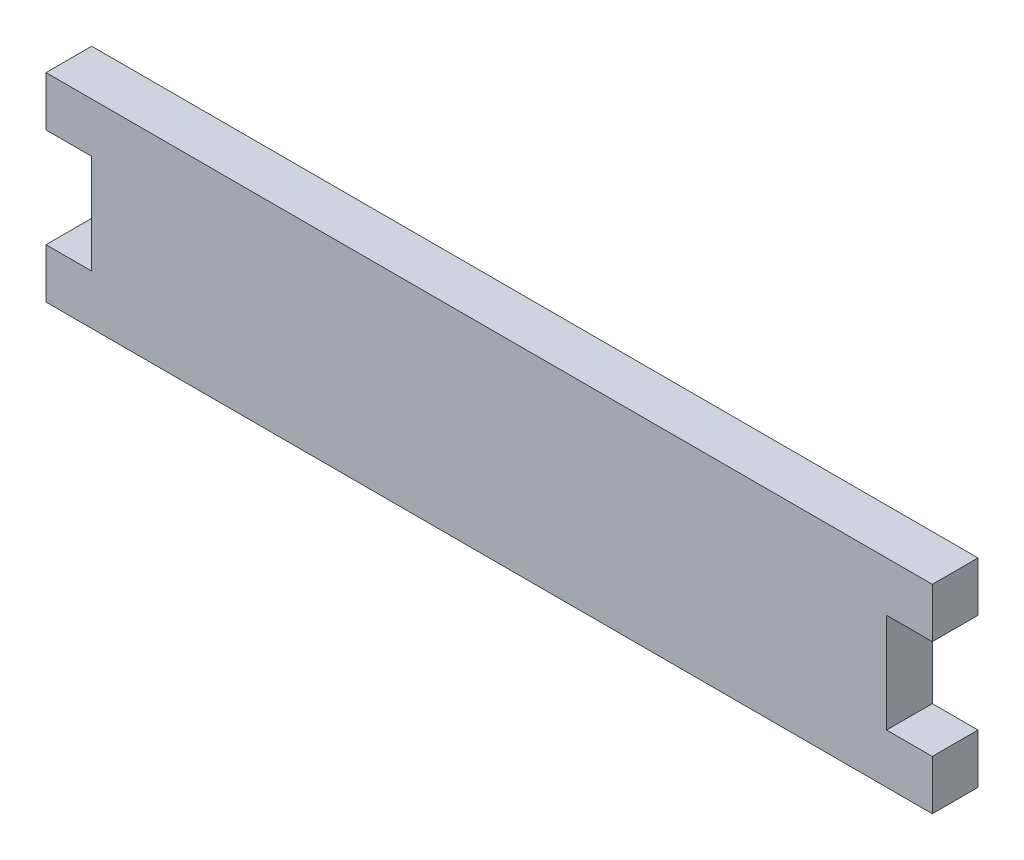
ISO-10303-21;
HEADER;
FILE_DESCRIPTION(('STEP AP214'),'2;1');
FILE_NAME('part.step','',(''),(''),'','','');
FILE_SCHEMA(('AUTOMOTIVE_DESIGN { 1 0 10303 214 1 1 1 1 }'));
ENDSEC;
DATA;
#1=APPLICATION_CONTEXT('core data for automotive mechanical design processes');
#2=APPLICATION_PROTOCOL_DEFINITION('international standard','automotive_design',2000,#1);
#3=PRODUCT_CONTEXT('',#1,'mechanical');
#4=PRODUCT('Part','Part','',(#3));
#5=PRODUCT_RELATED_PRODUCT_CATEGORY('part','',(#4));
#6=PRODUCT_DEFINITION_FORMATION('','',#4);
#7=PRODUCT_DEFINITION_CONTEXT('part definition',#1,'design');
#8=PRODUCT_DEFINITION('design','',#6,#7);
#9=PRODUCT_DEFINITION_SHAPE('','',#8);
#10=(LENGTH_UNIT() NAMED_UNIT(*) SI_UNIT(.MILLI.,.METRE.));
#11=(NAMED_UNIT(*) PLANE_ANGLE_UNIT() SI_UNIT($,.RADIAN.));
#12=(NAMED_UNIT(*) SI_UNIT($,.STERADIAN.) SOLID_ANGLE_UNIT());
#13=UNCERTAINTY_MEASURE_WITH_UNIT(LENGTH_MEASURE(1.E-05),#10,'distance_accuracy_value','');
#14=(GEOMETRIC_REPRESENTATION_CONTEXT(3) GLOBAL_UNCERTAINTY_ASSIGNED_CONTEXT((#13)) GLOBAL_UNIT_ASSIGNED_CONTEXT((#10,
#11,#12)) REPRESENTATION_CONTEXT('',''));
#15=CARTESIAN_POINT('',(0.,0.,0.));
#16=DIRECTION('',(0.,0.,1.));
#17=DIRECTION('',(1.,0.,0.));
#18=AXIS2_PLACEMENT_3D('',#15,#16,#17);
#19=CARTESIAN_POINT('',(0.,6.35000000000024,5.842));
#20=DIRECTION('',(0.,-1.,0.));
#21=DIRECTION('',(1.,0.,0.));
#22=AXIS2_PLACEMENT_3D('',#19,#20,#21);
#23=PLANE('',#22);
#24=DIRECTION('',(-1.,0.,0.));
#25=VECTOR('',#24,1.);
#26=CARTESIAN_POINT('',(0.,6.35000000000024,0.));
#27=LINE('',#26,#25);
#28=CARTESIAN_POINT('',(56.642,6.34999999999999,0.));
#29=VERTEX_POINT('',#28);
#30=CARTESIAN_POINT('',(50.8,6.35000000000001,0.));
#31=VERTEX_POINT('',#30);
#32=EDGE_CURVE('E155',#29,#31,#27,.T.);
#33=ORIENTED_EDGE('',*,*,#32,.F.);
#34=DIRECTION('',(0.,0.,-1.));
#35=VECTOR('',#34,1.);
#36=CARTESIAN_POINT('',(56.642,6.34999999999999,5.842));
#37=LINE('',#36,#35);
#38=CARTESIAN_POINT('',(56.642,6.34999999999999,5.842));
#39=VERTEX_POINT('',#38);
#40=EDGE_CURVE('E11',#39,#29,#37,.T.);
#41=ORIENTED_EDGE('',*,*,#40,.F.);
#42=DIRECTION('',(-1.,0.,0.));
#43=VECTOR('',#42,1.);
#44=CARTESIAN_POINT('',(0.,6.35000000000024,5.842));
#45=LINE('',#44,#43);
#46=CARTESIAN_POINT('',(50.8,6.35000000000001,5.842));
#47=VERTEX_POINT('',#46);
#48=EDGE_CURVE('E184',#39,#47,#45,.T.);
#49=ORIENTED_EDGE('',*,*,#48,.T.);
#50=DIRECTION('',(0.,0.,-1.));
#51=VECTOR('',#50,1.);
#52=CARTESIAN_POINT('',(50.8,6.35000000000001,5.842));
#53=LINE('',#52,#51);
#54=EDGE_CURVE('E99',#47,#31,#53,.T.);
#55=ORIENTED_EDGE('',*,*,#54,.T.);
#56=EDGE_LOOP('',(#33,#41,#49,#55));
#57=FACE_BOUND('',#56,.T.);
#58=ADVANCED_FACE('F37',(#57),#23,.T.);
#59=CARTESIAN_POINT('',(56.642,0.,5.842));
#60=DIRECTION('',(-1.,0.,0.));
#61=DIRECTION('',(0.,0.,1.));
#62=AXIS2_PLACEMENT_3D('',#59,#60,#61);
#63=PLANE('',#62);
#64=DIRECTION('',(0.,1.,0.));
#65=VECTOR('',#64,1.);
#66=CARTESIAN_POINT('',(56.642,0.,0.));
#67=LINE('',#66,#65);
#68=CARTESIAN_POINT('',(56.642,12.7,0.));
#69=VERTEX_POINT('',#68);
#70=EDGE_CURVE('E158',#29,#69,#67,.T.);
#71=ORIENTED_EDGE('',*,*,#70,.T.);
#72=DIRECTION('',(0.,0.,-1.));
#73=VECTOR('',#72,1.);
#74=CARTESIAN_POINT('',(56.642,12.7,5.842));
#75=LINE('',#74,#73);
#76=CARTESIAN_POINT('',(56.642,12.7,5.842));
#77=VERTEX_POINT('',#76);
#78=EDGE_CURVE('E45',#77,#69,#75,.T.);
#79=ORIENTED_EDGE('',*,*,#78,.F.);
#80=DIRECTION('',(0.,1.,0.));
#81=VECTOR('',#80,1.);
#82=CARTESIAN_POINT('',(56.642,0.,5.842));
#83=LINE('',#82,#81);
#84=EDGE_CURVE('E224',#39,#77,#83,.T.);
#85=ORIENTED_EDGE('',*,*,#84,.F.);
#86=ORIENTED_EDGE('',*,*,#40,.T.);
#87=EDGE_LOOP('',(#71,#79,#85,#86));
#88=FACE_BOUND('',#87,.T.);
#89=ADVANCED_FACE('F246',(#88),#63,.F.);
#90=CARTESIAN_POINT('',(0.,12.7000000000001,5.842));
#91=DIRECTION('',(0.,-1.,0.));
#92=DIRECTION('',(1.,0.,0.));
#93=AXIS2_PLACEMENT_3D('',#90,#91,#92);
#94=PLANE('',#93);
#95=DIRECTION('',(-1.,0.,0.));
#96=VECTOR('',#95,1.);
#97=CARTESIAN_POINT('',(0.,12.7000000000001,0.));
#98=LINE('',#97,#96);
#99=CARTESIAN_POINT('',(-56.642,12.7,0.));
#100=VERTEX_POINT('',#99);
#101=EDGE_CURVE('E160',#69,#100,#98,.T.);
#102=ORIENTED_EDGE('',*,*,#101,.T.);
#103=DIRECTION('',(0.,0.,-1.));
#104=VECTOR('',#103,1.);
#105=CARTESIAN_POINT('',(-56.642,12.7,5.842));
#106=LINE('',#105,#104);
#107=CARTESIAN_POINT('',(-56.642,12.7,5.842));
#108=VERTEX_POINT('',#107);
#109=EDGE_CURVE('E199',#108,#100,#106,.T.);
#110=ORIENTED_EDGE('',*,*,#109,.F.);
#111=DIRECTION('',(-1.,0.,0.));
#112=VECTOR('',#111,1.);
#113=CARTESIAN_POINT('',(0.,12.7000000000001,5.842));
#114=LINE('',#113,#112);
#115=EDGE_CURVE('E207',#77,#108,#114,.T.);
#116=ORIENTED_EDGE('',*,*,#115,.F.);
#117=ORIENTED_EDGE('',*,*,#78,.T.);
#118=EDGE_LOOP('',(#102,#110,#116,#117));
#119=FACE_BOUND('',#118,.T.);
#120=ADVANCED_FACE('F205',(#119),#94,.F.);
#121=CARTESIAN_POINT('',(-56.642,0.,5.842));
#122=DIRECTION('',(-1.,0.,0.));
#123=DIRECTION('',(0.,0.,1.));
#124=AXIS2_PLACEMENT_3D('',#121,#122,#123);
#125=PLANE('',#124);
#126=DIRECTION('',(0.,1.,0.));
#127=VECTOR('',#126,1.);
#128=CARTESIAN_POINT('',(-56.642,0.,0.));
#129=LINE('',#128,#127);
#130=CARTESIAN_POINT('',(-56.642,6.35,0.));
#131=VERTEX_POINT('',#130);
#132=EDGE_CURVE('E163',#131,#100,#129,.T.);
#133=ORIENTED_EDGE('',*,*,#132,.F.);
#134=DIRECTION('',(0.,0.,-1.));
#135=VECTOR('',#134,1.);
#136=CARTESIAN_POINT('',(-56.642,6.35,5.842));
#137=LINE('',#136,#135);
#138=CARTESIAN_POINT('',(-56.642,6.35,5.842));
#139=VERTEX_POINT('',#138);
#140=EDGE_CURVE('E197',#139,#131,#137,.T.);
#141=ORIENTED_EDGE('',*,*,#140,.F.);
#142=DIRECTION('',(0.,1.,0.));
#143=VECTOR('',#142,1.);
#144=CARTESIAN_POINT('',(-56.642,0.,5.842));
#145=LINE('',#144,#143);
#146=EDGE_CURVE('E219',#139,#108,#145,.T.);
#147=ORIENTED_EDGE('',*,*,#146,.T.);
#148=ORIENTED_EDGE('',*,*,#109,.T.);
#149=EDGE_LOOP('',(#133,#141,#147,#148));
#150=FACE_BOUND('',#149,.T.);
#151=ADVANCED_FACE('F215',(#150),#125,.T.);
#152=CARTESIAN_POINT('',(0.,6.35,5.842));
#153=DIRECTION('',(0.,1.,0.));
#154=DIRECTION('',(0.,0.,1.));
#155=AXIS2_PLACEMENT_3D('',#152,#153,#154);
#156=PLANE('',#155);
#157=DIRECTION('',(1.,0.,0.));
#158=VECTOR('',#157,1.);
#159=CARTESIAN_POINT('',(0.,6.35,0.));
#160=LINE('',#159,#158);
#161=CARTESIAN_POINT('',(-50.8,6.35,0.));
#162=VERTEX_POINT('',#161);
#163=EDGE_CURVE('E166',#131,#162,#160,.T.);
#164=ORIENTED_EDGE('',*,*,#163,.T.);
#165=DIRECTION('',(0.,0.,-1.));
#166=VECTOR('',#165,1.);
#167=CARTESIAN_POINT('',(-50.8,6.35,5.842));
#168=LINE('',#167,#166);
#169=CARTESIAN_POINT('',(-50.8,6.35,5.842));
#170=VERTEX_POINT('',#169);
#171=EDGE_CURVE('E195',#170,#162,#168,.T.);
#172=ORIENTED_EDGE('',*,*,#171,.F.);
#173=DIRECTION('',(1.,0.,0.));
#174=VECTOR('',#173,1.);
#175=CARTESIAN_POINT('',(0.,6.35,5.842));
#176=LINE('',#175,#174);
#177=EDGE_CURVE('E220',#139,#170,#176,.T.);
#178=ORIENTED_EDGE('',*,*,#177,.F.);
#179=ORIENTED_EDGE('',*,*,#140,.T.);
#180=EDGE_LOOP('',(#164,#172,#178,#179));
#181=FACE_BOUND('',#180,.T.);
#182=ADVANCED_FACE('F256',(#181),#156,.F.);
#183=CARTESIAN_POINT('',(-50.8,0.,5.842));
#184=DIRECTION('',(-1.,0.,0.));
#185=DIRECTION('',(0.,0.,1.));
#186=AXIS2_PLACEMENT_3D('',#183,#184,#185);
#187=PLANE('',#186);
#188=DIRECTION('',(0.,1.,0.));
#189=VECTOR('',#188,1.);
#190=CARTESIAN_POINT('',(-50.8,0.,0.));
#191=LINE('',#190,#189);
#192=CARTESIAN_POINT('',(-50.8,-6.35,0.));
#193=VERTEX_POINT('',#192);
#194=EDGE_CURVE('E169',#193,#162,#191,.T.);
#195=ORIENTED_EDGE('',*,*,#194,.F.);
#196=DIRECTION('',(0.,0.,-1.));
#197=VECTOR('',#196,1.);
#198=CARTESIAN_POINT('',(-50.8,-6.35,5.842));
#199=LINE('',#198,#197);
#200=CARTESIAN_POINT('',(-50.8,-6.35,5.842));
#201=VERTEX_POINT('',#200);
#202=EDGE_CURVE('E193',#201,#193,#199,.T.);
#203=ORIENTED_EDGE('',*,*,#202,.F.);
#204=DIRECTION('',(0.,1.,0.));
#205=VECTOR('',#204,1.);
#206=CARTESIAN_POINT('',(-50.8,0.,5.842));
#207=LINE('',#206,#205);
#208=EDGE_CURVE('E222',#201,#170,#207,.T.);
#209=ORIENTED_EDGE('',*,*,#208,.T.);
#210=ORIENTED_EDGE('',*,*,#171,.T.);
#211=EDGE_LOOP('',(#195,#203,#209,#210));
#212=FACE_BOUND('',#211,.T.);
#213=ADVANCED_FACE('F259',(#212),#187,.T.);
#214=CARTESIAN_POINT('',(0.,-6.35,5.842));
#215=DIRECTION('',(0.,1.,0.));
#216=DIRECTION('',(0.,0.,1.));
#217=AXIS2_PLACEMENT_3D('',#214,#215,#216);
#218=PLANE('',#217);
#219=DIRECTION('',(1.,0.,0.));
#220=VECTOR('',#219,1.);
#221=CARTESIAN_POINT('',(0.,-6.35,0.));
#222=LINE('',#221,#220);
#223=CARTESIAN_POINT('',(-56.642,-6.35,0.));
#224=VERTEX_POINT('',#223);
#225=EDGE_CURVE('E172',#224,#193,#222,.T.);
#226=ORIENTED_EDGE('',*,*,#225,.F.);
#227=DIRECTION('',(0.,0.,-1.));
#228=VECTOR('',#227,1.);
#229=CARTESIAN_POINT('',(-56.642,-6.35,5.842));
#230=LINE('',#229,#228);
#231=CARTESIAN_POINT('',(-56.642,-6.35,5.842));
#232=VERTEX_POINT('',#231);
#233=EDGE_CURVE('E191',#232,#224,#230,.T.);
#234=ORIENTED_EDGE('',*,*,#233,.F.);
#235=DIRECTION('',(1.,0.,0.));
#236=VECTOR('',#235,1.);
#237=CARTESIAN_POINT('',(0.,-6.35,5.842));
#238=LINE('',#237,#236);
#239=EDGE_CURVE('E230',#232,#201,#238,.T.);
#240=ORIENTED_EDGE('',*,*,#239,.T.);
#241=ORIENTED_EDGE('',*,*,#202,.T.);
#242=EDGE_LOOP('',(#226,#234,#240,#241));
#243=FACE_BOUND('',#242,.T.);
#244=ADVANCED_FACE('F263',(#243),#218,.T.);
#245=CARTESIAN_POINT('',(-56.642,0.,5.842));
#246=DIRECTION('',(1.,0.,0.));
#247=DIRECTION('',(0.,0.,-1.));
#248=AXIS2_PLACEMENT_3D('',#245,#246,#247);
#249=PLANE('',#248);
#250=DIRECTION('',(0.,-1.,0.));
#251=VECTOR('',#250,1.);
#252=CARTESIAN_POINT('',(-56.642,0.,0.));
#253=LINE('',#252,#251);
#254=CARTESIAN_POINT('',(-56.642,-12.7,0.));
#255=VERTEX_POINT('',#254);
#256=EDGE_CURVE('E175',#224,#255,#253,.T.);
#257=ORIENTED_EDGE('',*,*,#256,.T.);
#258=DIRECTION('',(0.,0.,-1.));
#259=VECTOR('',#258,1.);
#260=CARTESIAN_POINT('',(-56.642,-12.7,5.842));
#261=LINE('',#260,#259);
#262=CARTESIAN_POINT('',(-56.642,-12.7,5.842));
#263=VERTEX_POINT('',#262);
#264=EDGE_CURVE('E188',#263,#255,#261,.T.);
#265=ORIENTED_EDGE('',*,*,#264,.F.);
#266=DIRECTION('',(0.,-1.,0.));
#267=VECTOR('',#266,1.);
#268=CARTESIAN_POINT('',(-56.642,0.,5.842));
#269=LINE('',#268,#267);
#270=EDGE_CURVE('E150',#232,#263,#269,.T.);
#271=ORIENTED_EDGE('',*,*,#270,.F.);
#272=ORIENTED_EDGE('',*,*,#233,.T.);
#273=EDGE_LOOP('',(#257,#265,#271,#272));
#274=FACE_BOUND('',#273,.T.);
#275=ADVANCED_FACE('F237',(#274),#249,.F.);
#276=CARTESIAN_POINT('',(0.,-12.7,5.842));
#277=DIRECTION('',(0.,1.,0.));
#278=DIRECTION('',(0.,0.,1.));
#279=AXIS2_PLACEMENT_3D('',#276,#277,#278);
#280=PLANE('',#279);
#281=DIRECTION('',(1.,0.,0.));
#282=VECTOR('',#281,1.);
#283=CARTESIAN_POINT('',(0.,-12.7,0.));
#284=LINE('',#283,#282);
#285=CARTESIAN_POINT('',(56.642,-12.7,0.));
#286=VERTEX_POINT('',#285);
#287=EDGE_CURVE('E177',#255,#286,#284,.T.);
#288=ORIENTED_EDGE('',*,*,#287,.T.);
#289=DIRECTION('',(0.,0.,-1.));
#290=VECTOR('',#289,1.);
#291=CARTESIAN_POINT('',(56.642,-12.7,5.842));
#292=LINE('',#291,#290);
#293=CARTESIAN_POINT('',(56.642,-12.7,5.842));
#294=VERTEX_POINT('',#293);
#295=EDGE_CURVE('E139',#294,#286,#292,.T.);
#296=ORIENTED_EDGE('',*,*,#295,.F.);
#297=DIRECTION('',(1.,0.,0.));
#298=VECTOR('',#297,1.);
#299=CARTESIAN_POINT('',(0.,-12.7,5.842));
#300=LINE('',#299,#298);
#301=EDGE_CURVE('E147',#263,#294,#300,.T.);
#302=ORIENTED_EDGE('',*,*,#301,.F.);
#303=ORIENTED_EDGE('',*,*,#264,.T.);
#304=EDGE_LOOP('',(#288,#296,#302,#303));
#305=FACE_BOUND('',#304,.T.);
#306=ADVANCED_FACE('F241',(#305),#280,.F.);
#307=CARTESIAN_POINT('',(56.642,0.,5.842));
#308=DIRECTION('',(1.,0.,0.));
#309=DIRECTION('',(0.,0.,-1.));
#310=AXIS2_PLACEMENT_3D('',#307,#308,#309);
#311=PLANE('',#310);
#312=DIRECTION('',(0.,-1.,0.));
#313=VECTOR('',#312,1.);
#314=CARTESIAN_POINT('',(56.642,0.,0.));
#315=LINE('',#314,#313);
#316=CARTESIAN_POINT('',(56.642,-6.34999999999999,0.));
#317=VERTEX_POINT('',#316);
#318=EDGE_CURVE('E138',#317,#286,#315,.T.);
#319=ORIENTED_EDGE('',*,*,#318,.F.);
#320=DIRECTION('',(0.,0.,-1.));
#321=VECTOR('',#320,1.);
#322=CARTESIAN_POINT('',(56.642,-6.34999999999999,5.842));
#323=LINE('',#322,#321);
#324=CARTESIAN_POINT('',(56.642,-6.34999999999999,5.842));
#325=VERTEX_POINT('',#324);
#326=EDGE_CURVE('E132',#325,#317,#323,.T.);
#327=ORIENTED_EDGE('',*,*,#326,.F.);
#328=DIRECTION('',(0.,-1.,0.));
#329=VECTOR('',#328,1.);
#330=CARTESIAN_POINT('',(56.642,0.,5.842));
#331=LINE('',#330,#329);
#332=EDGE_CURVE('E136',#325,#294,#331,.T.);
#333=ORIENTED_EDGE('',*,*,#332,.T.);
#334=ORIENTED_EDGE('',*,*,#295,.T.);
#335=EDGE_LOOP('',(#319,#327,#333,#334));
#336=FACE_BOUND('',#335,.T.);
#337=ADVANCED_FACE('F134',(#336),#311,.T.);
#338=CARTESIAN_POINT('',(0.,-6.35000000000024,5.842));
#339=DIRECTION('',(0.,-1.,0.));
#340=DIRECTION('',(1.,0.,0.));
#341=AXIS2_PLACEMENT_3D('',#338,#339,#340);
#342=PLANE('',#341);
#343=DIRECTION('',(-1.,0.,0.));
#344=VECTOR('',#343,1.);
#345=CARTESIAN_POINT('',(0.,-6.35000000000024,0.));
#346=LINE('',#345,#344);
#347=CARTESIAN_POINT('',(50.8,-6.35000000000001,0.));
#348=VERTEX_POINT('',#347);
#349=EDGE_CURVE('E92',#317,#348,#346,.T.);
#350=ORIENTED_EDGE('',*,*,#349,.T.);
#351=DIRECTION('',(0.,0.,-1.));
#352=VECTOR('',#351,1.);
#353=CARTESIAN_POINT('',(50.8,-6.35000000000001,5.842));
#354=LINE('',#353,#352);
#355=CARTESIAN_POINT('',(50.8,-6.35000000000001,5.842));
#356=VERTEX_POINT('',#355);
#357=EDGE_CURVE('E140',#356,#348,#354,.T.);
#358=ORIENTED_EDGE('',*,*,#357,.F.);
#359=DIRECTION('',(-1.,0.,0.));
#360=VECTOR('',#359,1.);
#361=CARTESIAN_POINT('',(0.,-6.35000000000024,5.842));
#362=LINE('',#361,#360);
#363=EDGE_CURVE('E142',#325,#356,#362,.T.);
#364=ORIENTED_EDGE('',*,*,#363,.F.);
#365=ORIENTED_EDGE('',*,*,#326,.T.);
#366=EDGE_LOOP('',(#350,#358,#364,#365));
#367=FACE_BOUND('',#366,.T.);
#368=ADVANCED_FACE('F143',(#367),#342,.F.);
#369=CARTESIAN_POINT('',(50.8,0.,5.842));
#370=DIRECTION('',(-1.,0.,0.));
#371=DIRECTION('',(0.,0.,1.));
#372=AXIS2_PLACEMENT_3D('',#369,#370,#371);
#373=PLANE('',#372);
#374=DIRECTION('',(0.,1.,0.));
#375=VECTOR('',#374,1.);
#376=CARTESIAN_POINT('',(50.8,0.,0.));
#377=LINE('',#376,#375);
#378=EDGE_CURVE('E182',#348,#31,#377,.T.);
#379=ORIENTED_EDGE('',*,*,#378,.T.);
#380=ORIENTED_EDGE('',*,*,#54,.F.);
#381=DIRECTION('',(0.,1.,0.));
#382=VECTOR('',#381,1.);
#383=CARTESIAN_POINT('',(50.8,0.,5.842));
#384=LINE('',#383,#382);
#385=EDGE_CURVE('E53',#356,#47,#384,.T.);
#386=ORIENTED_EDGE('',*,*,#385,.F.);
#387=ORIENTED_EDGE('',*,*,#357,.T.);
#388=EDGE_LOOP('',(#379,#380,#386,#387));
#389=FACE_BOUND('',#388,.T.);
#390=ADVANCED_FACE('F244',(#389),#373,.F.);
#391=CARTESIAN_POINT('',(0.,0.,5.842));
#392=DIRECTION('',(0.,0.,1.));
#393=DIRECTION('',(1.,0.,0.));
#394=AXIS2_PLACEMENT_3D('',#391,#392,#393);
#395=PLANE('',#394);
#396=ORIENTED_EDGE('',*,*,#48,.F.);
#397=ORIENTED_EDGE('',*,*,#84,.T.);
#398=ORIENTED_EDGE('',*,*,#115,.T.);
#399=ORIENTED_EDGE('',*,*,#146,.F.);
#400=ORIENTED_EDGE('',*,*,#177,.T.);
#401=ORIENTED_EDGE('',*,*,#208,.F.);
#402=ORIENTED_EDGE('',*,*,#239,.F.);
#403=ORIENTED_EDGE('',*,*,#270,.T.);
#404=ORIENTED_EDGE('',*,*,#301,.T.);
#405=ORIENTED_EDGE('',*,*,#332,.F.);
#406=ORIENTED_EDGE('',*,*,#363,.T.);
#407=ORIENTED_EDGE('',*,*,#385,.T.);
#408=EDGE_LOOP('',(#396,#397,#398,#399,#400,#401,#402,#403,#404,#405,#406,#407));
#409=FACE_BOUND('',#408,.T.);
#410=ADVANCED_FACE('F145',(#409),#395,.T.);
#411=CARTESIAN_POINT('',(0.,0.,0.));
#412=DIRECTION('',(0.,0.,1.));
#413=DIRECTION('',(1.,0.,0.));
#414=AXIS2_PLACEMENT_3D('',#411,#412,#413);
#415=PLANE('',#414);
#416=ORIENTED_EDGE('',*,*,#32,.T.);
#417=ORIENTED_EDGE('',*,*,#378,.F.);
#418=ORIENTED_EDGE('',*,*,#349,.F.);
#419=ORIENTED_EDGE('',*,*,#318,.T.);
#420=ORIENTED_EDGE('',*,*,#287,.F.);
#421=ORIENTED_EDGE('',*,*,#256,.F.);
#422=ORIENTED_EDGE('',*,*,#225,.T.);
#423=ORIENTED_EDGE('',*,*,#194,.T.);
#424=ORIENTED_EDGE('',*,*,#163,.F.);
#425=ORIENTED_EDGE('',*,*,#132,.T.);
#426=ORIENTED_EDGE('',*,*,#101,.F.);
#427=ORIENTED_EDGE('',*,*,#70,.F.);
#428=EDGE_LOOP('',(#416,#417,#418,#419,#420,#421,#422,#423,#424,#425,#426,#427));
#429=FACE_BOUND('',#428,.T.);
#430=ADVANCED_FACE('F211',(#429),#415,.F.);
#431=CLOSED_SHELL('',(#58,#89,#120,#151,#182,#213,#244,#275,#306,#337,#368,#390,#410,#430));
#432=MANIFOLD_SOLID_BREP('B2',#431);
#433=ADVANCED_BREP_SHAPE_REPRESENTATION('',(#18,#432),#14);
#434=SHAPE_DEFINITION_REPRESENTATION(#9,#433);
ENDSEC;
END-ISO-10303-21;
